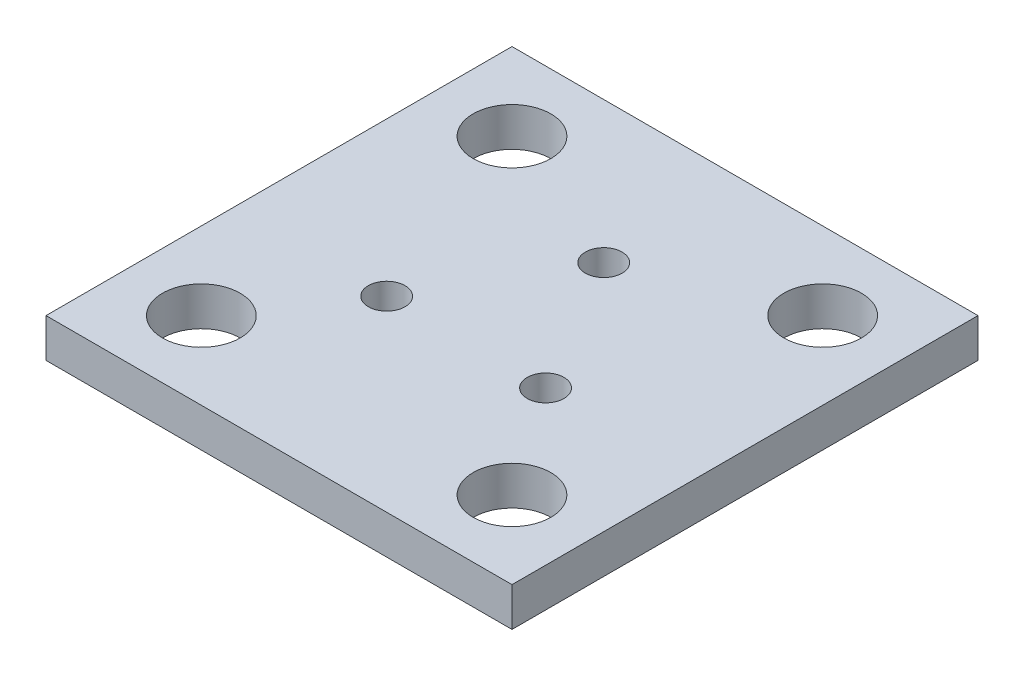
ISO-10303-21;
HEADER;
FILE_DESCRIPTION(('STEP AP214'),'2;1');
FILE_NAME('part.step','',(''),(''),'','','');
FILE_SCHEMA(('AUTOMOTIVE_DESIGN { 1 0 10303 214 1 1 1 1 }'));
ENDSEC;
DATA;
#1=APPLICATION_CONTEXT('core data for automotive mechanical design processes');
#2=APPLICATION_PROTOCOL_DEFINITION('international standard','automotive_design',2000,#1);
#3=PRODUCT_CONTEXT('',#1,'mechanical');
#4=PRODUCT('Part','Part','',(#3));
#5=PRODUCT_RELATED_PRODUCT_CATEGORY('part','',(#4));
#6=PRODUCT_DEFINITION_FORMATION('','',#4);
#7=PRODUCT_DEFINITION_CONTEXT('part definition',#1,'design');
#8=PRODUCT_DEFINITION('design','',#6,#7);
#9=PRODUCT_DEFINITION_SHAPE('','',#8);
#10=(LENGTH_UNIT() NAMED_UNIT(*) SI_UNIT(.MILLI.,.METRE.));
#11=(NAMED_UNIT(*) PLANE_ANGLE_UNIT() SI_UNIT($,.RADIAN.));
#12=(NAMED_UNIT(*) SI_UNIT($,.STERADIAN.) SOLID_ANGLE_UNIT());
#13=UNCERTAINTY_MEASURE_WITH_UNIT(LENGTH_MEASURE(1.E-05),#10,'distance_accuracy_value','');
#14=(GEOMETRIC_REPRESENTATION_CONTEXT(3) GLOBAL_UNCERTAINTY_ASSIGNED_CONTEXT((#13)) GLOBAL_UNIT_ASSIGNED_CONTEXT((#10,
#11,#12)) REPRESENTATION_CONTEXT('',''));
#15=CARTESIAN_POINT('',(0.,0.,0.));
#16=DIRECTION('',(0.,0.,1.));
#17=DIRECTION('',(1.,0.,0.));
#18=AXIS2_PLACEMENT_3D('',#15,#16,#17);
#19=CARTESIAN_POINT('',(19.05,3.175,19.05));
#20=DIRECTION('',(-1.,0.,0.));
#21=DIRECTION('',(0.,0.,1.));
#22=AXIS2_PLACEMENT_3D('',#19,#20,#21);
#23=PLANE('',#22);
#24=DIRECTION('',(0.,0.,-1.));
#25=VECTOR('',#24,1.);
#26=CARTESIAN_POINT('',(19.05,0.,19.05));
#27=LINE('',#26,#25);
#28=CARTESIAN_POINT('',(19.05,0.,19.05));
#29=VERTEX_POINT('',#28);
#30=CARTESIAN_POINT('',(19.05,0.,-19.05));
#31=VERTEX_POINT('',#30);
#32=EDGE_CURVE('E96',#29,#31,#27,.T.);
#33=ORIENTED_EDGE('',*,*,#32,.T.);
#34=DIRECTION('',(0.,-1.,0.));
#35=VECTOR('',#34,1.);
#36=CARTESIAN_POINT('',(19.05,3.175,-19.05));
#37=LINE('',#36,#35);
#38=CARTESIAN_POINT('',(19.05,3.175,-19.05));
#39=VERTEX_POINT('',#38);
#40=EDGE_CURVE('E11',#39,#31,#37,.T.);
#41=ORIENTED_EDGE('',*,*,#40,.F.);
#42=DIRECTION('',(0.,0.,-1.));
#43=VECTOR('',#42,1.);
#44=CARTESIAN_POINT('',(19.05,3.175,19.05));
#45=LINE('',#44,#43);
#46=CARTESIAN_POINT('',(19.05,3.175,19.05));
#47=VERTEX_POINT('',#46);
#48=EDGE_CURVE('E84',#47,#39,#45,.T.);
#49=ORIENTED_EDGE('',*,*,#48,.F.);
#50=DIRECTION('',(0.,-1.,0.));
#51=VECTOR('',#50,1.);
#52=CARTESIAN_POINT('',(19.05,3.175,19.05));
#53=LINE('',#52,#51);
#54=EDGE_CURVE('E92',#47,#29,#53,.T.);
#55=ORIENTED_EDGE('',*,*,#54,.T.);
#56=EDGE_LOOP('',(#33,#41,#49,#55));
#57=FACE_BOUND('',#56,.T.);
#58=ADVANCED_FACE('F33',(#57),#23,.F.);
#59=CARTESIAN_POINT('',(-19.05,3.175,-19.05));
#60=DIRECTION('',(0.,0.,1.));
#61=DIRECTION('',(1.,0.,0.));
#62=AXIS2_PLACEMENT_3D('',#59,#60,#61);
#63=PLANE('',#62);
#64=DIRECTION('',(-1.,0.,0.));
#65=VECTOR('',#64,1.);
#66=CARTESIAN_POINT('',(-19.05,0.,-19.05));
#67=LINE('',#66,#65);
#68=CARTESIAN_POINT('',(-19.05,0.,-19.05));
#69=VERTEX_POINT('',#68);
#70=EDGE_CURVE('E88',#31,#69,#67,.T.);
#71=ORIENTED_EDGE('',*,*,#70,.T.);
#72=DIRECTION('',(0.,-1.,0.));
#73=VECTOR('',#72,1.);
#74=CARTESIAN_POINT('',(-19.05,3.175,-19.05));
#75=LINE('',#74,#73);
#76=CARTESIAN_POINT('',(-19.05,3.175,-19.05));
#77=VERTEX_POINT('',#76);
#78=EDGE_CURVE('E41',#77,#69,#75,.T.);
#79=ORIENTED_EDGE('',*,*,#78,.F.);
#80=DIRECTION('',(-1.,0.,0.));
#81=VECTOR('',#80,1.);
#82=CARTESIAN_POINT('',(-19.05,3.175,-19.05));
#83=LINE('',#82,#81);
#84=EDGE_CURVE('E79',#39,#77,#83,.T.);
#85=ORIENTED_EDGE('',*,*,#84,.F.);
#86=ORIENTED_EDGE('',*,*,#40,.T.);
#87=EDGE_LOOP('',(#71,#79,#85,#86));
#88=FACE_BOUND('',#87,.T.);
#89=ADVANCED_FACE('F87',(#88),#63,.F.);
#90=CARTESIAN_POINT('',(-19.05,3.175,19.05));
#91=DIRECTION('',(1.,0.,0.));
#92=DIRECTION('',(0.,0.,-1.));
#93=AXIS2_PLACEMENT_3D('',#90,#91,#92);
#94=PLANE('',#93);
#95=DIRECTION('',(0.,0.,1.));
#96=VECTOR('',#95,1.);
#97=CARTESIAN_POINT('',(-19.05,0.,19.05));
#98=LINE('',#97,#96);
#99=CARTESIAN_POINT('',(-19.05,0.,19.05));
#100=VERTEX_POINT('',#99);
#101=EDGE_CURVE('E66',#69,#100,#98,.T.);
#102=ORIENTED_EDGE('',*,*,#101,.T.);
#103=DIRECTION('',(0.,-1.,0.));
#104=VECTOR('',#103,1.);
#105=CARTESIAN_POINT('',(-19.05,3.175,19.05));
#106=LINE('',#105,#104);
#107=CARTESIAN_POINT('',(-19.05,3.175,19.05));
#108=VERTEX_POINT('',#107);
#109=EDGE_CURVE('E89',#108,#100,#106,.T.);
#110=ORIENTED_EDGE('',*,*,#109,.F.);
#111=DIRECTION('',(0.,0.,1.));
#112=VECTOR('',#111,1.);
#113=CARTESIAN_POINT('',(-19.05,3.175,19.05));
#114=LINE('',#113,#112);
#115=EDGE_CURVE('E82',#77,#108,#114,.T.);
#116=ORIENTED_EDGE('',*,*,#115,.F.);
#117=ORIENTED_EDGE('',*,*,#78,.T.);
#118=EDGE_LOOP('',(#102,#110,#116,#117));
#119=FACE_BOUND('',#118,.T.);
#120=ADVANCED_FACE('F90',(#119),#94,.F.);
#121=CARTESIAN_POINT('',(-19.05,3.175,19.05));
#122=DIRECTION('',(0.,0.,-1.));
#123=DIRECTION('',(-1.,0.,0.));
#124=AXIS2_PLACEMENT_3D('',#121,#122,#123);
#125=PLANE('',#124);
#126=DIRECTION('',(1.,0.,0.));
#127=VECTOR('',#126,1.);
#128=CARTESIAN_POINT('',(-19.05,0.,19.05));
#129=LINE('',#128,#127);
#130=EDGE_CURVE('E72',#100,#29,#129,.T.);
#131=ORIENTED_EDGE('',*,*,#130,.T.);
#132=ORIENTED_EDGE('',*,*,#54,.F.);
#133=DIRECTION('',(1.,0.,0.));
#134=VECTOR('',#133,1.);
#135=CARTESIAN_POINT('',(-19.05,3.175,19.05));
#136=LINE('',#135,#134);
#137=EDGE_CURVE('E49',#108,#47,#136,.T.);
#138=ORIENTED_EDGE('',*,*,#137,.F.);
#139=ORIENTED_EDGE('',*,*,#109,.T.);
#140=EDGE_LOOP('',(#131,#132,#138,#139));
#141=FACE_BOUND('',#140,.T.);
#142=ADVANCED_FACE('F104',(#141),#125,.F.);
#143=CARTESIAN_POINT('',(0.,3.175,0.));
#144=DIRECTION('',(0.,-1.,0.));
#145=DIRECTION('',(0.,0.,-1.));
#146=AXIS2_PLACEMENT_3D('',#143,#144,#145);
#147=PLANE('',#146);
#148=CARTESIAN_POINT('',(12.7,3.175,-12.7));
#149=DIRECTION('',(0.,1.,0.));
#150=DIRECTION('',(0.,0.,1.));
#151=AXIS2_PLACEMENT_3D('',#148,#149,#150);
#152=CIRCLE('',#151,3.175);
#153=CARTESIAN_POINT('',(12.7,3.175,-9.525));
#154=VERTEX_POINT('',#153);
#155=EDGE_CURVE('E134',#154,#154,#152,.T.);
#156=ORIENTED_EDGE('',*,*,#155,.F.);
#157=EDGE_LOOP('',(#156));
#158=FACE_BOUND('',#157,.T.);
#159=CARTESIAN_POINT('',(12.7000000000003,3.175,12.7));
#160=DIRECTION('',(0.,1.,0.));
#161=DIRECTION('',(0.,0.,1.));
#162=AXIS2_PLACEMENT_3D('',#159,#160,#161);
#163=CIRCLE('',#162,3.175);
#164=CARTESIAN_POINT('',(12.7000000000003,3.175,15.875));
#165=VERTEX_POINT('',#164);
#166=EDGE_CURVE('E140',#165,#165,#163,.T.);
#167=ORIENTED_EDGE('',*,*,#166,.F.);
#168=EDGE_LOOP('',(#167));
#169=FACE_BOUND('',#168,.T.);
#170=CARTESIAN_POINT('',(-12.6999999999997,3.175,12.7));
#171=DIRECTION('',(0.,1.,0.));
#172=DIRECTION('',(0.,0.,1.));
#173=AXIS2_PLACEMENT_3D('',#170,#171,#172);
#174=CIRCLE('',#173,3.175);
#175=CARTESIAN_POINT('',(-12.6999999999997,3.175,15.875));
#176=VERTEX_POINT('',#175);
#177=EDGE_CURVE('E146',#176,#176,#174,.T.);
#178=ORIENTED_EDGE('',*,*,#177,.F.);
#179=EDGE_LOOP('',(#178));
#180=FACE_BOUND('',#179,.T.);
#181=CARTESIAN_POINT('',(-12.7,3.175,-12.7));
#182=DIRECTION('',(0.,1.,0.));
#183=DIRECTION('',(0.,0.,1.));
#184=AXIS2_PLACEMENT_3D('',#181,#182,#183);
#185=CIRCLE('',#184,3.175);
#186=CARTESIAN_POINT('',(-12.7,3.175,-9.525));
#187=VERTEX_POINT('',#186);
#188=EDGE_CURVE('E128',#187,#187,#185,.T.);
#189=ORIENTED_EDGE('',*,*,#188,.F.);
#190=EDGE_LOOP('',(#189));
#191=FACE_BOUND('',#190,.T.);
#192=CARTESIAN_POINT('',(0.,3.175,-7.5));
#193=DIRECTION('',(0.,1.,0.));
#194=DIRECTION('',(0.,0.,1.));
#195=AXIS2_PLACEMENT_3D('',#192,#193,#194);
#196=CIRCLE('',#195,1.5);
#197=CARTESIAN_POINT('',(0.,3.175,-6.));
#198=VERTEX_POINT('',#197);
#199=EDGE_CURVE('E123',#198,#198,#196,.T.);
#200=ORIENTED_EDGE('',*,*,#199,.F.);
#201=EDGE_LOOP('',(#200));
#202=FACE_BOUND('',#201,.T.);
#203=CARTESIAN_POINT('',(-6.49519052838272,3.175,3.75000000000033));
#204=DIRECTION('',(0.,1.,0.));
#205=DIRECTION('',(0.,0.,1.));
#206=AXIS2_PLACEMENT_3D('',#203,#204,#205);
#207=CIRCLE('',#206,1.5);
#208=CARTESIAN_POINT('',(-6.49519052838272,3.175,5.25000000000033));
#209=VERTEX_POINT('',#208);
#210=EDGE_CURVE('E120',#209,#209,#207,.T.);
#211=ORIENTED_EDGE('',*,*,#210,.F.);
#212=EDGE_LOOP('',(#211));
#213=FACE_BOUND('',#212,.T.);
#214=CARTESIAN_POINT('',(6.49519052838386,3.175,3.74999999999966));
#215=DIRECTION('',(0.,1.,0.));
#216=DIRECTION('',(0.,0.,1.));
#217=AXIS2_PLACEMENT_3D('',#214,#215,#216);
#218=CIRCLE('',#217,1.5);
#219=CARTESIAN_POINT('',(6.49519052838386,3.175,5.24999999999966));
#220=VERTEX_POINT('',#219);
#221=EDGE_CURVE('E113',#220,#220,#218,.T.);
#222=ORIENTED_EDGE('',*,*,#221,.F.);
#223=EDGE_LOOP('',(#222));
#224=FACE_BOUND('',#223,.T.);
#225=ORIENTED_EDGE('',*,*,#48,.T.);
#226=ORIENTED_EDGE('',*,*,#84,.T.);
#227=ORIENTED_EDGE('',*,*,#115,.T.);
#228=ORIENTED_EDGE('',*,*,#137,.T.);
#229=EDGE_LOOP('',(#225,#226,#227,#228));
#230=FACE_BOUND('',#229,.T.);
#231=ADVANCED_FACE('F80',(#158,#169,#180,#191,#202,#213,#224,#230),#147,.F.);
#232=CARTESIAN_POINT('',(0.,0.,0.));
#233=DIRECTION('',(0.,-1.,0.));
#234=DIRECTION('',(0.,0.,-1.));
#235=AXIS2_PLACEMENT_3D('',#232,#233,#234);
#236=PLANE('',#235);
#237=CARTESIAN_POINT('',(12.7,0.,-12.7));
#238=DIRECTION('',(0.,1.,0.));
#239=DIRECTION('',(0.,0.,1.));
#240=AXIS2_PLACEMENT_3D('',#237,#238,#239);
#241=CIRCLE('',#240,3.175);
#242=CARTESIAN_POINT('',(12.7,0.,-9.525));
#243=VERTEX_POINT('',#242);
#244=EDGE_CURVE('E137',#243,#243,#241,.T.);
#245=ORIENTED_EDGE('',*,*,#244,.T.);
#246=EDGE_LOOP('',(#245));
#247=FACE_BOUND('',#246,.T.);
#248=CARTESIAN_POINT('',(12.7000000000003,0.,12.7));
#249=DIRECTION('',(0.,1.,0.));
#250=DIRECTION('',(0.,0.,1.));
#251=AXIS2_PLACEMENT_3D('',#248,#249,#250);
#252=CIRCLE('',#251,3.175);
#253=CARTESIAN_POINT('',(12.7000000000003,0.,15.875));
#254=VERTEX_POINT('',#253);
#255=EDGE_CURVE('E143',#254,#254,#252,.T.);
#256=ORIENTED_EDGE('',*,*,#255,.T.);
#257=EDGE_LOOP('',(#256));
#258=FACE_BOUND('',#257,.T.);
#259=CARTESIAN_POINT('',(-12.6999999999997,0.,12.7));
#260=DIRECTION('',(0.,1.,0.));
#261=DIRECTION('',(0.,0.,1.));
#262=AXIS2_PLACEMENT_3D('',#259,#260,#261);
#263=CIRCLE('',#262,3.175);
#264=CARTESIAN_POINT('',(-12.6999999999997,0.,15.875));
#265=VERTEX_POINT('',#264);
#266=EDGE_CURVE('E131',#265,#265,#263,.T.);
#267=ORIENTED_EDGE('',*,*,#266,.T.);
#268=EDGE_LOOP('',(#267));
#269=FACE_BOUND('',#268,.T.);
#270=CARTESIAN_POINT('',(-12.7,0.,-12.7));
#271=DIRECTION('',(0.,1.,0.));
#272=DIRECTION('',(0.,0.,1.));
#273=AXIS2_PLACEMENT_3D('',#270,#271,#272);
#274=CIRCLE('',#273,3.175);
#275=CARTESIAN_POINT('',(-12.7,0.,-9.525));
#276=VERTEX_POINT('',#275);
#277=EDGE_CURVE('E114',#276,#276,#274,.T.);
#278=ORIENTED_EDGE('',*,*,#277,.T.);
#279=EDGE_LOOP('',(#278));
#280=FACE_BOUND('',#279,.T.);
#281=CARTESIAN_POINT('',(0.,0.,-7.5));
#282=DIRECTION('',(0.,1.,0.));
#283=DIRECTION('',(0.,0.,1.));
#284=AXIS2_PLACEMENT_3D('',#281,#282,#283);
#285=CIRCLE('',#284,1.5);
#286=CARTESIAN_POINT('',(0.,0.,-6.));
#287=VERTEX_POINT('',#286);
#288=EDGE_CURVE('E99',#287,#287,#285,.T.);
#289=ORIENTED_EDGE('',*,*,#288,.T.);
#290=EDGE_LOOP('',(#289));
#291=FACE_BOUND('',#290,.T.);
#292=CARTESIAN_POINT('',(-6.49519052838272,0.,3.75000000000033));
#293=DIRECTION('',(0.,1.,0.));
#294=DIRECTION('',(0.,0.,1.));
#295=AXIS2_PLACEMENT_3D('',#292,#293,#294);
#296=CIRCLE('',#295,1.5);
#297=CARTESIAN_POINT('',(-6.49519052838272,0.,5.25000000000033));
#298=VERTEX_POINT('',#297);
#299=EDGE_CURVE('E117',#298,#298,#296,.T.);
#300=ORIENTED_EDGE('',*,*,#299,.T.);
#301=EDGE_LOOP('',(#300));
#302=FACE_BOUND('',#301,.T.);
#303=CARTESIAN_POINT('',(6.49519052838386,0.,3.74999999999966));
#304=DIRECTION('',(0.,1.,0.));
#305=DIRECTION('',(0.,0.,1.));
#306=AXIS2_PLACEMENT_3D('',#303,#304,#305);
#307=CIRCLE('',#306,1.5);
#308=CARTESIAN_POINT('',(6.49519052838386,0.,5.24999999999966));
#309=VERTEX_POINT('',#308);
#310=EDGE_CURVE('E110',#309,#309,#307,.T.);
#311=ORIENTED_EDGE('',*,*,#310,.T.);
#312=EDGE_LOOP('',(#311));
#313=FACE_BOUND('',#312,.T.);
#314=ORIENTED_EDGE('',*,*,#32,.F.);
#315=ORIENTED_EDGE('',*,*,#130,.F.);
#316=ORIENTED_EDGE('',*,*,#101,.F.);
#317=ORIENTED_EDGE('',*,*,#70,.F.);
#318=EDGE_LOOP('',(#314,#315,#316,#317));
#319=FACE_BOUND('',#318,.T.);
#320=ADVANCED_FACE('F107',(#247,#258,#269,#280,#291,#302,#313,#319),#236,.T.);
#321=CARTESIAN_POINT('',(6.49519052838386,0.,3.74999999999966));
#322=DIRECTION('',(0.,1.,0.));
#323=DIRECTION('',(0.,0.,1.));
#324=AXIS2_PLACEMENT_3D('',#321,#322,#323);
#325=CYLINDRICAL_SURFACE('',#324,1.5);
#326=ORIENTED_EDGE('',*,*,#310,.F.);
#327=EDGE_LOOP('',(#326));
#328=FACE_BOUND('',#327,.T.);
#329=ORIENTED_EDGE('',*,*,#221,.T.);
#330=EDGE_LOOP('',(#329));
#331=FACE_BOUND('',#330,.T.);
#332=ADVANCED_FACE('F174',(#328,#331),#325,.F.);
#333=CARTESIAN_POINT('',(-6.49519052838272,0.,3.75000000000033));
#334=DIRECTION('',(0.,1.,0.));
#335=DIRECTION('',(0.,0.,1.));
#336=AXIS2_PLACEMENT_3D('',#333,#334,#335);
#337=CYLINDRICAL_SURFACE('',#336,1.5);
#338=ORIENTED_EDGE('',*,*,#299,.F.);
#339=EDGE_LOOP('',(#338));
#340=FACE_BOUND('',#339,.T.);
#341=ORIENTED_EDGE('',*,*,#210,.T.);
#342=EDGE_LOOP('',(#341));
#343=FACE_BOUND('',#342,.T.);
#344=ADVANCED_FACE('F176',(#340,#343),#337,.F.);
#345=CARTESIAN_POINT('',(0.,0.,-7.5));
#346=DIRECTION('',(0.,1.,0.));
#347=DIRECTION('',(0.,0.,1.));
#348=AXIS2_PLACEMENT_3D('',#345,#346,#347);
#349=CYLINDRICAL_SURFACE('',#348,1.5);
#350=ORIENTED_EDGE('',*,*,#288,.F.);
#351=EDGE_LOOP('',(#350));
#352=FACE_BOUND('',#351,.T.);
#353=ORIENTED_EDGE('',*,*,#199,.T.);
#354=EDGE_LOOP('',(#353));
#355=FACE_BOUND('',#354,.T.);
#356=ADVANCED_FACE('F183',(#352,#355),#349,.F.);
#357=CARTESIAN_POINT('',(-12.7,0.,-12.7));
#358=DIRECTION('',(0.,1.,0.));
#359=DIRECTION('',(0.,0.,1.));
#360=AXIS2_PLACEMENT_3D('',#357,#358,#359);
#361=CYLINDRICAL_SURFACE('',#360,3.175);
#362=ORIENTED_EDGE('',*,*,#277,.F.);
#363=EDGE_LOOP('',(#362));
#364=FACE_BOUND('',#363,.T.);
#365=ORIENTED_EDGE('',*,*,#188,.T.);
#366=EDGE_LOOP('',(#365));
#367=FACE_BOUND('',#366,.T.);
#368=ADVANCED_FACE('F158',(#364,#367),#361,.F.);
#369=CARTESIAN_POINT('',(-12.6999999999997,0.,12.7));
#370=DIRECTION('',(0.,1.,0.));
#371=DIRECTION('',(0.,0.,1.));
#372=AXIS2_PLACEMENT_3D('',#369,#370,#371);
#373=CYLINDRICAL_SURFACE('',#372,3.175);
#374=ORIENTED_EDGE('',*,*,#266,.F.);
#375=EDGE_LOOP('',(#374));
#376=FACE_BOUND('',#375,.T.);
#377=ORIENTED_EDGE('',*,*,#177,.T.);
#378=EDGE_LOOP('',(#377));
#379=FACE_BOUND('',#378,.T.);
#380=ADVANCED_FACE('F154',(#376,#379),#373,.F.);
#381=CARTESIAN_POINT('',(12.7000000000003,0.,12.7));
#382=DIRECTION('',(0.,1.,0.));
#383=DIRECTION('',(0.,0.,1.));
#384=AXIS2_PLACEMENT_3D('',#381,#382,#383);
#385=CYLINDRICAL_SURFACE('',#384,3.175);
#386=ORIENTED_EDGE('',*,*,#255,.F.);
#387=EDGE_LOOP('',(#386));
#388=FACE_BOUND('',#387,.T.);
#389=ORIENTED_EDGE('',*,*,#166,.T.);
#390=EDGE_LOOP('',(#389));
#391=FACE_BOUND('',#390,.T.);
#392=ADVANCED_FACE('F157',(#388,#391),#385,.F.);
#393=CARTESIAN_POINT('',(12.7,0.,-12.7));
#394=DIRECTION('',(0.,1.,0.));
#395=DIRECTION('',(0.,0.,1.));
#396=AXIS2_PLACEMENT_3D('',#393,#394,#395);
#397=CYLINDRICAL_SURFACE('',#396,3.175);
#398=ORIENTED_EDGE('',*,*,#244,.F.);
#399=EDGE_LOOP('',(#398));
#400=FACE_BOUND('',#399,.T.);
#401=ORIENTED_EDGE('',*,*,#155,.T.);
#402=EDGE_LOOP('',(#401));
#403=FACE_BOUND('',#402,.T.);
#404=ADVANCED_FACE('F239',(#400,#403),#397,.F.);
#405=CLOSED_SHELL('',(#58,#89,#120,#142,#231,#320,#332,#344,#356,#368,#380,#392,#404));
#406=MANIFOLD_SOLID_BREP('B2',#405);
#407=ADVANCED_BREP_SHAPE_REPRESENTATION('',(#18,#406),#14);
#408=SHAPE_DEFINITION_REPRESENTATION(#9,#407);
ENDSEC;
END-ISO-10303-21;
